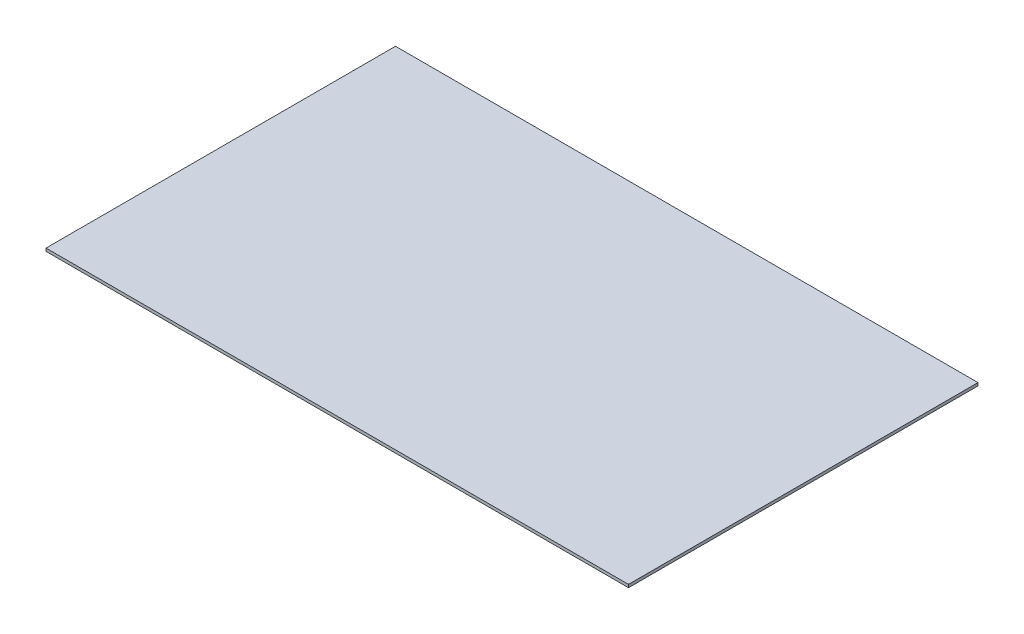
ISO-10303-21;
HEADER;
FILE_DESCRIPTION(('STEP AP214'),'2;1');
FILE_NAME('part.step','',(''),(''),'','','');
FILE_SCHEMA(('AUTOMOTIVE_DESIGN { 1 0 10303 214 1 1 1 1 }'));
ENDSEC;
DATA;
#1=APPLICATION_CONTEXT('core data for automotive mechanical design processes');
#2=APPLICATION_PROTOCOL_DEFINITION('international standard','automotive_design',2000,#1);
#3=PRODUCT_CONTEXT('',#1,'mechanical');
#4=PRODUCT('Part','Part','',(#3));
#5=PRODUCT_RELATED_PRODUCT_CATEGORY('part','',(#4));
#6=PRODUCT_DEFINITION_FORMATION('','',#4);
#7=PRODUCT_DEFINITION_CONTEXT('part definition',#1,'design');
#8=PRODUCT_DEFINITION('design','',#6,#7);
#9=PRODUCT_DEFINITION_SHAPE('','',#8);
#10=(LENGTH_UNIT() NAMED_UNIT(*) SI_UNIT(.MILLI.,.METRE.));
#11=(NAMED_UNIT(*) PLANE_ANGLE_UNIT() SI_UNIT($,.RADIAN.));
#12=(NAMED_UNIT(*) SI_UNIT($,.STERADIAN.) SOLID_ANGLE_UNIT());
#13=UNCERTAINTY_MEASURE_WITH_UNIT(LENGTH_MEASURE(1.E-05),#10,'distance_accuracy_value','');
#14=(GEOMETRIC_REPRESENTATION_CONTEXT(3) GLOBAL_UNCERTAINTY_ASSIGNED_CONTEXT((#13)) GLOBAL_UNIT_ASSIGNED_CONTEXT((#10,
#11,#12)) REPRESENTATION_CONTEXT('',''));
#15=CARTESIAN_POINT('',(0.,0.,0.));
#16=DIRECTION('',(0.,0.,1.));
#17=DIRECTION('',(1.,0.,0.));
#18=AXIS2_PLACEMENT_3D('',#15,#16,#17);
#19=CARTESIAN_POINT('',(254.,2.54,152.4));
#20=DIRECTION('',(-1.,0.,0.));
#21=DIRECTION('',(0.,0.,1.));
#22=AXIS2_PLACEMENT_3D('',#19,#20,#21);
#23=PLANE('',#22);
#24=DIRECTION('',(0.,0.,-1.));
#25=VECTOR('',#24,1.);
#26=CARTESIAN_POINT('',(254.,0.,152.4));
#27=LINE('',#26,#25);
#28=CARTESIAN_POINT('',(254.,0.,152.4));
#29=VERTEX_POINT('',#28);
#30=CARTESIAN_POINT('',(254.,0.,-152.4));
#31=VERTEX_POINT('',#30);
#32=EDGE_CURVE('E98',#29,#31,#27,.T.);
#33=ORIENTED_EDGE('',*,*,#32,.T.);
#34=DIRECTION('',(0.,-1.,0.));
#35=VECTOR('',#34,1.);
#36=CARTESIAN_POINT('',(254.,2.54,-152.4));
#37=LINE('',#36,#35);
#38=CARTESIAN_POINT('',(254.,2.54,-152.4));
#39=VERTEX_POINT('',#38);
#40=EDGE_CURVE('E11',#39,#31,#37,.T.);
#41=ORIENTED_EDGE('',*,*,#40,.F.);
#42=DIRECTION('',(0.,0.,-1.));
#43=VECTOR('',#42,1.);
#44=CARTESIAN_POINT('',(254.,2.54,152.4));
#45=LINE('',#44,#43);
#46=CARTESIAN_POINT('',(254.,2.54,152.4));
#47=VERTEX_POINT('',#46);
#48=EDGE_CURVE('E86',#47,#39,#45,.T.);
#49=ORIENTED_EDGE('',*,*,#48,.F.);
#50=DIRECTION('',(0.,-1.,0.));
#51=VECTOR('',#50,1.);
#52=CARTESIAN_POINT('',(254.,2.54,152.4));
#53=LINE('',#52,#51);
#54=EDGE_CURVE('E94',#47,#29,#53,.T.);
#55=ORIENTED_EDGE('',*,*,#54,.T.);
#56=EDGE_LOOP('',(#33,#41,#49,#55));
#57=FACE_BOUND('',#56,.T.);
#58=ADVANCED_FACE('F35',(#57),#23,.F.);
#59=CARTESIAN_POINT('',(-254.,2.54,-152.4));
#60=DIRECTION('',(0.,0.,1.));
#61=DIRECTION('',(1.,0.,0.));
#62=AXIS2_PLACEMENT_3D('',#59,#60,#61);
#63=PLANE('',#62);
#64=DIRECTION('',(-1.,0.,0.));
#65=VECTOR('',#64,1.);
#66=CARTESIAN_POINT('',(-254.,0.,-152.4));
#67=LINE('',#66,#65);
#68=CARTESIAN_POINT('',(-254.,0.,-152.4));
#69=VERTEX_POINT('',#68);
#70=EDGE_CURVE('E90',#31,#69,#67,.T.);
#71=ORIENTED_EDGE('',*,*,#70,.T.);
#72=DIRECTION('',(0.,-1.,0.));
#73=VECTOR('',#72,1.);
#74=CARTESIAN_POINT('',(-254.,2.54,-152.4));
#75=LINE('',#74,#73);
#76=CARTESIAN_POINT('',(-254.,2.54,-152.4));
#77=VERTEX_POINT('',#76);
#78=EDGE_CURVE('E43',#77,#69,#75,.T.);
#79=ORIENTED_EDGE('',*,*,#78,.F.);
#80=DIRECTION('',(-1.,0.,0.));
#81=VECTOR('',#80,1.);
#82=CARTESIAN_POINT('',(-254.,2.54,-152.4));
#83=LINE('',#82,#81);
#84=EDGE_CURVE('E81',#39,#77,#83,.T.);
#85=ORIENTED_EDGE('',*,*,#84,.F.);
#86=ORIENTED_EDGE('',*,*,#40,.T.);
#87=EDGE_LOOP('',(#71,#79,#85,#86));
#88=FACE_BOUND('',#87,.T.);
#89=ADVANCED_FACE('F89',(#88),#63,.F.);
#90=CARTESIAN_POINT('',(-254.,2.54,152.4));
#91=DIRECTION('',(1.,0.,0.));
#92=DIRECTION('',(0.,0.,-1.));
#93=AXIS2_PLACEMENT_3D('',#90,#91,#92);
#94=PLANE('',#93);
#95=DIRECTION('',(0.,0.,1.));
#96=VECTOR('',#95,1.);
#97=CARTESIAN_POINT('',(-254.,0.,152.4));
#98=LINE('',#97,#96);
#99=CARTESIAN_POINT('',(-254.,0.,152.4));
#100=VERTEX_POINT('',#99);
#101=EDGE_CURVE('E68',#69,#100,#98,.T.);
#102=ORIENTED_EDGE('',*,*,#101,.T.);
#103=DIRECTION('',(0.,-1.,0.));
#104=VECTOR('',#103,1.);
#105=CARTESIAN_POINT('',(-254.,2.54,152.4));
#106=LINE('',#105,#104);
#107=CARTESIAN_POINT('',(-254.,2.54,152.4));
#108=VERTEX_POINT('',#107);
#109=EDGE_CURVE('E91',#108,#100,#106,.T.);
#110=ORIENTED_EDGE('',*,*,#109,.F.);
#111=DIRECTION('',(0.,0.,1.));
#112=VECTOR('',#111,1.);
#113=CARTESIAN_POINT('',(-254.,2.54,152.4));
#114=LINE('',#113,#112);
#115=EDGE_CURVE('E84',#77,#108,#114,.T.);
#116=ORIENTED_EDGE('',*,*,#115,.F.);
#117=ORIENTED_EDGE('',*,*,#78,.T.);
#118=EDGE_LOOP('',(#102,#110,#116,#117));
#119=FACE_BOUND('',#118,.T.);
#120=ADVANCED_FACE('F92',(#119),#94,.F.);
#121=CARTESIAN_POINT('',(-254.,2.54,152.4));
#122=DIRECTION('',(0.,0.,-1.));
#123=DIRECTION('',(-1.,0.,0.));
#124=AXIS2_PLACEMENT_3D('',#121,#122,#123);
#125=PLANE('',#124);
#126=DIRECTION('',(1.,0.,0.));
#127=VECTOR('',#126,1.);
#128=CARTESIAN_POINT('',(-254.,0.,152.4));
#129=LINE('',#128,#127);
#130=EDGE_CURVE('E74',#100,#29,#129,.T.);
#131=ORIENTED_EDGE('',*,*,#130,.T.);
#132=ORIENTED_EDGE('',*,*,#54,.F.);
#133=DIRECTION('',(1.,0.,0.));
#134=VECTOR('',#133,1.);
#135=CARTESIAN_POINT('',(-254.,2.54,152.4));
#136=LINE('',#135,#134);
#137=EDGE_CURVE('E51',#108,#47,#136,.T.);
#138=ORIENTED_EDGE('',*,*,#137,.F.);
#139=ORIENTED_EDGE('',*,*,#109,.T.);
#140=EDGE_LOOP('',(#131,#132,#138,#139));
#141=FACE_BOUND('',#140,.T.);
#142=ADVANCED_FACE('F105',(#141),#125,.F.);
#143=CARTESIAN_POINT('',(0.,2.54,0.));
#144=DIRECTION('',(0.,-1.,0.));
#145=DIRECTION('',(0.,0.,-1.));
#146=AXIS2_PLACEMENT_3D('',#143,#144,#145);
#147=PLANE('',#146);
#148=ORIENTED_EDGE('',*,*,#48,.T.);
#149=ORIENTED_EDGE('',*,*,#84,.T.);
#150=ORIENTED_EDGE('',*,*,#115,.T.);
#151=ORIENTED_EDGE('',*,*,#137,.T.);
#152=EDGE_LOOP('',(#148,#149,#150,#151));
#153=FACE_BOUND('',#152,.T.);
#154=ADVANCED_FACE('F82',(#153),#147,.F.);
#155=CARTESIAN_POINT('',(0.,0.,0.));
#156=DIRECTION('',(0.,-1.,0.));
#157=DIRECTION('',(0.,0.,-1.));
#158=AXIS2_PLACEMENT_3D('',#155,#156,#157);
#159=PLANE('',#158);
#160=ORIENTED_EDGE('',*,*,#32,.F.);
#161=ORIENTED_EDGE('',*,*,#130,.F.);
#162=ORIENTED_EDGE('',*,*,#101,.F.);
#163=ORIENTED_EDGE('',*,*,#70,.F.);
#164=EDGE_LOOP('',(#160,#161,#162,#163));
#165=FACE_BOUND('',#164,.T.);
#166=ADVANCED_FACE('F108',(#165),#159,.T.);
#167=CLOSED_SHELL('',(#58,#89,#120,#142,#154,#166));
#168=MANIFOLD_SOLID_BREP('B2',#167);
#169=ADVANCED_BREP_SHAPE_REPRESENTATION('',(#18,#168),#14);
#170=SHAPE_DEFINITION_REPRESENTATION(#9,#169);
ENDSEC;
END-ISO-10303-21;
